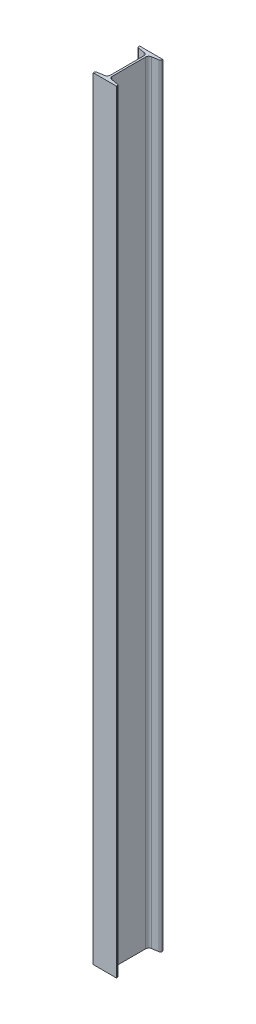
ISO-10303-21;
HEADER;
FILE_DESCRIPTION(('STEP AP214'),'2;1');
FILE_NAME('part.step','',(''),(''),'','','');
FILE_SCHEMA(('AUTOMOTIVE_DESIGN { 1 0 10303 214 1 1 1 1 }'));
ENDSEC;
DATA;
#1=APPLICATION_CONTEXT('core data for automotive mechanical design processes');
#2=APPLICATION_PROTOCOL_DEFINITION('international standard','automotive_design',2000,#1);
#3=PRODUCT_CONTEXT('',#1,'mechanical');
#4=PRODUCT('Part','Part','',(#3));
#5=PRODUCT_RELATED_PRODUCT_CATEGORY('part','',(#4));
#6=PRODUCT_DEFINITION_FORMATION('','',#4);
#7=PRODUCT_DEFINITION_CONTEXT('part definition',#1,'design');
#8=PRODUCT_DEFINITION('design','',#6,#7);
#9=PRODUCT_DEFINITION_SHAPE('','',#8);
#10=(LENGTH_UNIT() NAMED_UNIT(*) SI_UNIT(.MILLI.,.METRE.));
#11=(NAMED_UNIT(*) PLANE_ANGLE_UNIT() SI_UNIT($,.RADIAN.));
#12=(NAMED_UNIT(*) SI_UNIT($,.STERADIAN.) SOLID_ANGLE_UNIT());
#13=UNCERTAINTY_MEASURE_WITH_UNIT(LENGTH_MEASURE(1.E-05),#10,'distance_accuracy_value','');
#14=(GEOMETRIC_REPRESENTATION_CONTEXT(3) GLOBAL_UNCERTAINTY_ASSIGNED_CONTEXT((#13)) GLOBAL_UNIT_ASSIGNED_CONTEXT((#10,
#11,#12)) REPRESENTATION_CONTEXT('',''));
#15=CARTESIAN_POINT('',(0.,0.,0.));
#16=DIRECTION('',(0.,0.,1.));
#17=DIRECTION('',(1.,0.,0.));
#18=AXIS2_PLACEMENT_3D('',#15,#16,#17);
#19=CARTESIAN_POINT('',(-30.,2000.,-60.));
#20=DIRECTION('',(0.,0.,1.));
#21=DIRECTION('',(1.,0.,0.));
#22=AXIS2_PLACEMENT_3D('',#19,#20,#21);
#23=PLANE('',#22);
#24=DIRECTION('',(-1.,0.,0.));
#25=VECTOR('',#24,1.);
#26=CARTESIAN_POINT('',(-30.,0.,-60.));
#27=LINE('',#26,#25);
#28=CARTESIAN_POINT('',(30.,0.,-60.));
#29=VERTEX_POINT('',#28);
#30=CARTESIAN_POINT('',(-30.,0.,-60.));
#31=VERTEX_POINT('',#30);
#32=EDGE_CURVE('E271',#29,#31,#27,.T.);
#33=ORIENTED_EDGE('',*,*,#32,.T.);
#34=DIRECTION('',(0.,-1.,0.));
#35=VECTOR('',#34,1.);
#36=CARTESIAN_POINT('',(-30.,2000.,-60.));
#37=LINE('',#36,#35);
#38=CARTESIAN_POINT('',(-30.,2000.,-60.));
#39=VERTEX_POINT('',#38);
#40=EDGE_CURVE('E13',#39,#31,#37,.T.);
#41=ORIENTED_EDGE('',*,*,#40,.F.);
#42=DIRECTION('',(-1.,0.,0.));
#43=VECTOR('',#42,1.);
#44=CARTESIAN_POINT('',(-30.,2000.,-60.));
#45=LINE('',#44,#43);
#46=CARTESIAN_POINT('',(30.,2000.,-60.));
#47=VERTEX_POINT('',#46);
#48=EDGE_CURVE('E309',#47,#39,#45,.T.);
#49=ORIENTED_EDGE('',*,*,#48,.F.);
#50=DIRECTION('',(0.,-1.,0.));
#51=VECTOR('',#50,1.);
#52=CARTESIAN_POINT('',(30.,2000.,-60.));
#53=LINE('',#52,#51);
#54=EDGE_CURVE('E267',#47,#29,#53,.T.);
#55=ORIENTED_EDGE('',*,*,#54,.T.);
#56=EDGE_LOOP('',(#33,#41,#49,#55));
#57=FACE_BOUND('',#56,.T.);
#58=ADVANCED_FACE('F103',(#57),#23,.F.);
#59=CARTESIAN_POINT('',(-30.,2000.,-58.0800708346734));
#60=DIRECTION('',(1.,0.,0.));
#61=DIRECTION('',(0.,0.,-1.));
#62=AXIS2_PLACEMENT_3D('',#59,#60,#61);
#63=PLANE('',#62);
#64=DIRECTION('',(0.,0.,1.));
#65=VECTOR('',#64,1.);
#66=CARTESIAN_POINT('',(-30.,0.,-58.0800708346734));
#67=LINE('',#66,#65);
#68=CARTESIAN_POINT('',(-30.,0.,-58.0800708346734));
#69=VERTEX_POINT('',#68);
#70=EDGE_CURVE('E274',#31,#69,#67,.T.);
#71=ORIENTED_EDGE('',*,*,#70,.T.);
#72=DIRECTION('',(0.,-1.,0.));
#73=VECTOR('',#72,1.);
#74=CARTESIAN_POINT('',(-30.,2000.,-58.0800708346734));
#75=LINE('',#74,#73);
#76=CARTESIAN_POINT('',(-30.,2000.,-58.0800708346734));
#77=VERTEX_POINT('',#76);
#78=EDGE_CURVE('E111',#77,#69,#75,.T.);
#79=ORIENTED_EDGE('',*,*,#78,.F.);
#80=DIRECTION('',(0.,0.,1.));
#81=VECTOR('',#80,1.);
#82=CARTESIAN_POINT('',(-30.,2000.,-58.0800708346734));
#83=LINE('',#82,#81);
#84=EDGE_CURVE('E198',#39,#77,#83,.T.);
#85=ORIENTED_EDGE('',*,*,#84,.F.);
#86=ORIENTED_EDGE('',*,*,#40,.T.);
#87=EDGE_LOOP('',(#71,#79,#85,#86));
#88=FACE_BOUND('',#87,.T.);
#89=ADVANCED_FACE('F427',(#88),#63,.F.);
#90=CARTESIAN_POINT('',(-26.,2000.,-58.0800708346734));
#91=DIRECTION('',(0.,-1.,0.));
#92=DIRECTION('',(0.,0.,-1.));
#93=AXIS2_PLACEMENT_3D('',#90,#91,#92);
#94=CYLINDRICAL_SURFACE('',#93,4.00000000000001);
#95=CARTESIAN_POINT('',(-26.,0.,-58.0800708346734));
#96=DIRECTION('',(0.,1.,0.));
#97=DIRECTION('',(0.,0.,1.));
#98=AXIS2_PLACEMENT_3D('',#95,#96,#97);
#99=CIRCLE('',#98,4.00000000000001);
#100=CARTESIAN_POINT('',(-26.6576426241585,0.,-54.1345029187848));
#101=VERTEX_POINT('',#100);
#102=EDGE_CURVE('E276',#69,#101,#99,.T.);
#103=ORIENTED_EDGE('',*,*,#102,.T.);
#104=DIRECTION('',(0.,-1.,0.));
#105=VECTOR('',#104,1.);
#106=CARTESIAN_POINT('',(-26.6576426241585,2000.,-54.1345029187848));
#107=LINE('',#106,#105);
#108=CARTESIAN_POINT('',(-26.6576426241585,2000.,-54.1345029187848));
#109=VERTEX_POINT('',#108);
#110=EDGE_CURVE('E352',#109,#101,#107,.T.);
#111=ORIENTED_EDGE('',*,*,#110,.F.);
#112=CARTESIAN_POINT('',(-26.,2000.,-58.0800708346734));
#113=DIRECTION('',(0.,1.,0.));
#114=DIRECTION('',(0.,0.,1.));
#115=AXIS2_PLACEMENT_3D('',#112,#113,#114);
#116=CIRCLE('',#115,4.00000000000001);
#117=EDGE_CURVE('E360',#77,#109,#116,.T.);
#118=ORIENTED_EDGE('',*,*,#117,.F.);
#119=ORIENTED_EDGE('',*,*,#78,.T.);
#120=EDGE_LOOP('',(#103,#111,#118,#119));
#121=FACE_BOUND('',#120,.T.);
#122=ADVANCED_FACE('F358',(#121),#94,.T.);
#123=CARTESIAN_POINT('',(-9.18471475168301,2000.,-51.2221358317773));
#124=DIRECTION('',(0.164410656039623,0.,-0.986391978972163));
#125=DIRECTION('',(-0.986391978972163,0.,-0.164410656039623));
#126=AXIS2_PLACEMENT_3D('',#123,#124,#125);
#127=PLANE('',#126);
#128=DIRECTION('',(0.986391978972163,0.,0.164410656039623));
#129=VECTOR('',#128,1.);
#130=CARTESIAN_POINT('',(-9.18471475168301,0.,-51.2221358317773));
#131=LINE('',#130,#129);
#132=CARTESIAN_POINT('',(-9.18471475168301,0.,-51.2221358317773));
#133=VERTEX_POINT('',#132);
#134=EDGE_CURVE('E278',#101,#133,#131,.T.);
#135=ORIENTED_EDGE('',*,*,#134,.T.);
#136=DIRECTION('',(0.,-1.,0.));
#137=VECTOR('',#136,1.);
#138=CARTESIAN_POINT('',(-9.18471475168301,2000.,-51.2221358317773));
#139=LINE('',#138,#137);
#140=CARTESIAN_POINT('',(-9.18471475168301,2000.,-51.2221358317773));
#141=VERTEX_POINT('',#140);
#142=EDGE_CURVE('E349',#141,#133,#139,.T.);
#143=ORIENTED_EDGE('',*,*,#142,.F.);
#144=DIRECTION('',(0.986391978972163,0.,0.164410656039623));
#145=VECTOR('',#144,1.);
#146=CARTESIAN_POINT('',(-9.18471475168301,2000.,-51.2221358317773));
#147=LINE('',#146,#145);
#148=EDGE_CURVE('E378',#109,#141,#147,.T.);
#149=ORIENTED_EDGE('',*,*,#148,.F.);
#150=ORIENTED_EDGE('',*,*,#110,.T.);
#151=EDGE_LOOP('',(#135,#143,#149,#150));
#152=FACE_BOUND('',#151,.T.);
#153=ADVANCED_FACE('F369',(#152),#127,.F.);
#154=CARTESIAN_POINT('',(-10.5,2000.,-43.331));
#155=DIRECTION('',(0.,-1.,0.));
#156=DIRECTION('',(0.,0.,-1.));
#157=AXIS2_PLACEMENT_3D('',#154,#155,#156);
#158=CYLINDRICAL_SURFACE('',#157,8.);
#159=CARTESIAN_POINT('',(-10.5,0.,-43.331));
#160=DIRECTION('',(0.,-1.,0.));
#161=DIRECTION('',(0.,0.,1.));
#162=AXIS2_PLACEMENT_3D('',#159,#160,#161);
#163=CIRCLE('',#162,8.);
#164=CARTESIAN_POINT('',(-2.5,0.,-43.331));
#165=VERTEX_POINT('',#164);
#166=EDGE_CURVE('E280',#133,#165,#163,.T.);
#167=ORIENTED_EDGE('',*,*,#166,.T.);
#168=DIRECTION('',(0.,-1.,0.));
#169=VECTOR('',#168,1.);
#170=CARTESIAN_POINT('',(-2.5,2000.,-43.331));
#171=LINE('',#170,#169);
#172=CARTESIAN_POINT('',(-2.5,2000.,-43.331));
#173=VERTEX_POINT('',#172);
#174=EDGE_CURVE('E346',#173,#165,#171,.T.);
#175=ORIENTED_EDGE('',*,*,#174,.F.);
#176=CARTESIAN_POINT('',(-10.5,2000.,-43.331));
#177=DIRECTION('',(0.,-1.,0.));
#178=DIRECTION('',(0.,0.,1.));
#179=AXIS2_PLACEMENT_3D('',#176,#177,#178);
#180=CIRCLE('',#179,8.);
#181=EDGE_CURVE('E375',#141,#173,#180,.T.);
#182=ORIENTED_EDGE('',*,*,#181,.F.);
#183=ORIENTED_EDGE('',*,*,#142,.T.);
#184=EDGE_LOOP('',(#167,#175,#182,#183));
#185=FACE_BOUND('',#184,.T.);
#186=ADVANCED_FACE('F373',(#185),#158,.F.);
#187=CARTESIAN_POINT('',(-2.49999999999999,2000.,43.331));
#188=DIRECTION('',(1.,0.,0.));
#189=DIRECTION('',(0.,0.,-1.));
#190=AXIS2_PLACEMENT_3D('',#187,#188,#189);
#191=PLANE('',#190);
#192=DIRECTION('',(0.,0.,1.));
#193=VECTOR('',#192,1.);
#194=CARTESIAN_POINT('',(-2.49999999999999,0.,43.331));
#195=LINE('',#194,#193);
#196=CARTESIAN_POINT('',(-2.49999999999999,0.,43.331));
#197=VERTEX_POINT('',#196);
#198=EDGE_CURVE('E282',#165,#197,#195,.T.);
#199=ORIENTED_EDGE('',*,*,#198,.T.);
#200=DIRECTION('',(0.,-1.,0.));
#201=VECTOR('',#200,1.);
#202=CARTESIAN_POINT('',(-2.49999999999999,2000.,43.331));
#203=LINE('',#202,#201);
#204=CARTESIAN_POINT('',(-2.49999999999999,2000.,43.331));
#205=VERTEX_POINT('',#204);
#206=EDGE_CURVE('E343',#205,#197,#203,.T.);
#207=ORIENTED_EDGE('',*,*,#206,.F.);
#208=DIRECTION('',(0.,0.,1.));
#209=VECTOR('',#208,1.);
#210=CARTESIAN_POINT('',(-2.49999999999999,2000.,43.331));
#211=LINE('',#210,#209);
#212=EDGE_CURVE('E377',#173,#205,#211,.T.);
#213=ORIENTED_EDGE('',*,*,#212,.F.);
#214=ORIENTED_EDGE('',*,*,#174,.T.);
#215=EDGE_LOOP('',(#199,#207,#213,#214));
#216=FACE_BOUND('',#215,.T.);
#217=ADVANCED_FACE('F440',(#216),#191,.F.);
#218=CARTESIAN_POINT('',(-10.5,2000.,43.331));
#219=DIRECTION('',(0.,-1.,0.));
#220=DIRECTION('',(0.,0.,-1.));
#221=AXIS2_PLACEMENT_3D('',#218,#219,#220);
#222=CYLINDRICAL_SURFACE('',#221,8.);
#223=CARTESIAN_POINT('',(-10.5,0.,43.331));
#224=DIRECTION('',(0.,-1.,0.));
#225=DIRECTION('',(0.,0.,1.));
#226=AXIS2_PLACEMENT_3D('',#223,#224,#225);
#227=CIRCLE('',#226,8.);
#228=CARTESIAN_POINT('',(-9.184714751683,0.,51.2221358317773));
#229=VERTEX_POINT('',#228);
#230=EDGE_CURVE('E284',#197,#229,#227,.T.);
#231=ORIENTED_EDGE('',*,*,#230,.T.);
#232=DIRECTION('',(0.,-1.,0.));
#233=VECTOR('',#232,1.);
#234=CARTESIAN_POINT('',(-9.184714751683,2000.,51.2221358317773));
#235=LINE('',#234,#233);
#236=CARTESIAN_POINT('',(-9.184714751683,2000.,51.2221358317773));
#237=VERTEX_POINT('',#236);
#238=EDGE_CURVE('E340',#237,#229,#235,.T.);
#239=ORIENTED_EDGE('',*,*,#238,.F.);
#240=CARTESIAN_POINT('',(-10.5,2000.,43.331));
#241=DIRECTION('',(0.,-1.,0.));
#242=DIRECTION('',(0.,0.,1.));
#243=AXIS2_PLACEMENT_3D('',#240,#241,#242);
#244=CIRCLE('',#243,8.);
#245=EDGE_CURVE('E380',#205,#237,#244,.T.);
#246=ORIENTED_EDGE('',*,*,#245,.F.);
#247=ORIENTED_EDGE('',*,*,#206,.T.);
#248=EDGE_LOOP('',(#231,#239,#246,#247));
#249=FACE_BOUND('',#248,.T.);
#250=ADVANCED_FACE('F443',(#249),#222,.F.);
#251=CARTESIAN_POINT('',(-26.6576426241585,2000.,54.1345029187848));
#252=DIRECTION('',(0.164410656039624,0.,0.986391978972163));
#253=DIRECTION('',(0.986391978972163,0.,-0.164410656039624));
#254=AXIS2_PLACEMENT_3D('',#251,#252,#253);
#255=PLANE('',#254);
#256=DIRECTION('',(-0.986391978972163,0.,0.164410656039624));
#257=VECTOR('',#256,1.);
#258=CARTESIAN_POINT('',(-26.6576426241585,0.,54.1345029187848));
#259=LINE('',#258,#257);
#260=CARTESIAN_POINT('',(-26.6576426241585,0.,54.1345029187848));
#261=VERTEX_POINT('',#260);
#262=EDGE_CURVE('E286',#229,#261,#259,.T.);
#263=ORIENTED_EDGE('',*,*,#262,.T.);
#264=DIRECTION('',(0.,-1.,0.));
#265=VECTOR('',#264,1.);
#266=CARTESIAN_POINT('',(-26.6576426241585,2000.,54.1345029187848));
#267=LINE('',#266,#265);
#268=CARTESIAN_POINT('',(-26.6576426241585,2000.,54.1345029187848));
#269=VERTEX_POINT('',#268);
#270=EDGE_CURVE('E337',#269,#261,#267,.T.);
#271=ORIENTED_EDGE('',*,*,#270,.F.);
#272=DIRECTION('',(-0.986391978972163,0.,0.164410656039624));
#273=VECTOR('',#272,1.);
#274=CARTESIAN_POINT('',(-26.6576426241585,2000.,54.1345029187848));
#275=LINE('',#274,#273);
#276=EDGE_CURVE('E386',#237,#269,#275,.T.);
#277=ORIENTED_EDGE('',*,*,#276,.F.);
#278=ORIENTED_EDGE('',*,*,#238,.T.);
#279=EDGE_LOOP('',(#263,#271,#277,#278));
#280=FACE_BOUND('',#279,.T.);
#281=ADVANCED_FACE('F447',(#280),#255,.F.);
#282=CARTESIAN_POINT('',(-26.,2000.,58.0800708346735));
#283=DIRECTION('',(0.,-1.,0.));
#284=DIRECTION('',(0.,0.,-1.));
#285=AXIS2_PLACEMENT_3D('',#282,#283,#284);
#286=CYLINDRICAL_SURFACE('',#285,4.);
#287=CARTESIAN_POINT('',(-26.,0.,58.0800708346735));
#288=DIRECTION('',(0.,1.,0.));
#289=DIRECTION('',(0.,0.,1.));
#290=AXIS2_PLACEMENT_3D('',#287,#288,#289);
#291=CIRCLE('',#290,4.);
#292=CARTESIAN_POINT('',(-30.,0.,58.0800708346735));
#293=VERTEX_POINT('',#292);
#294=EDGE_CURVE('E288',#261,#293,#291,.T.);
#295=ORIENTED_EDGE('',*,*,#294,.T.);
#296=DIRECTION('',(0.,-1.,0.));
#297=VECTOR('',#296,1.);
#298=CARTESIAN_POINT('',(-30.,2000.,58.0800708346735));
#299=LINE('',#298,#297);
#300=CARTESIAN_POINT('',(-30.,2000.,58.0800708346735));
#301=VERTEX_POINT('',#300);
#302=EDGE_CURVE('E334',#301,#293,#299,.T.);
#303=ORIENTED_EDGE('',*,*,#302,.F.);
#304=CARTESIAN_POINT('',(-26.,2000.,58.0800708346735));
#305=DIRECTION('',(0.,1.,0.));
#306=DIRECTION('',(0.,0.,1.));
#307=AXIS2_PLACEMENT_3D('',#304,#305,#306);
#308=CIRCLE('',#307,4.);
#309=EDGE_CURVE('E388',#269,#301,#308,.T.);
#310=ORIENTED_EDGE('',*,*,#309,.F.);
#311=ORIENTED_EDGE('',*,*,#270,.T.);
#312=EDGE_LOOP('',(#295,#303,#310,#311));
#313=FACE_BOUND('',#312,.T.);
#314=ADVANCED_FACE('F451',(#313),#286,.T.);
#315=CARTESIAN_POINT('',(-30.,2000.,60.));
#316=DIRECTION('',(1.,0.,0.));
#317=DIRECTION('',(0.,0.,-1.));
#318=AXIS2_PLACEMENT_3D('',#315,#316,#317);
#319=PLANE('',#318);
#320=DIRECTION('',(0.,0.,1.));
#321=VECTOR('',#320,1.);
#322=CARTESIAN_POINT('',(-30.,0.,60.));
#323=LINE('',#322,#321);
#324=CARTESIAN_POINT('',(-30.,0.,60.));
#325=VERTEX_POINT('',#324);
#326=EDGE_CURVE('E290',#293,#325,#323,.T.);
#327=ORIENTED_EDGE('',*,*,#326,.T.);
#328=DIRECTION('',(0.,-1.,0.));
#329=VECTOR('',#328,1.);
#330=CARTESIAN_POINT('',(-30.,2000.,60.));
#331=LINE('',#330,#329);
#332=CARTESIAN_POINT('',(-30.,2000.,60.));
#333=VERTEX_POINT('',#332);
#334=EDGE_CURVE('E331',#333,#325,#331,.T.);
#335=ORIENTED_EDGE('',*,*,#334,.F.);
#336=DIRECTION('',(0.,0.,1.));
#337=VECTOR('',#336,1.);
#338=CARTESIAN_POINT('',(-30.,2000.,60.));
#339=LINE('',#338,#337);
#340=EDGE_CURVE('E390',#301,#333,#339,.T.);
#341=ORIENTED_EDGE('',*,*,#340,.F.);
#342=ORIENTED_EDGE('',*,*,#302,.T.);
#343=EDGE_LOOP('',(#327,#335,#341,#342));
#344=FACE_BOUND('',#343,.T.);
#345=ADVANCED_FACE('F455',(#344),#319,.F.);
#346=CARTESIAN_POINT('',(30.,2000.,60.));
#347=DIRECTION('',(0.,0.,-1.));
#348=DIRECTION('',(-1.,0.,0.));
#349=AXIS2_PLACEMENT_3D('',#346,#347,#348);
#350=PLANE('',#349);
#351=DIRECTION('',(1.,0.,0.));
#352=VECTOR('',#351,1.);
#353=CARTESIAN_POINT('',(30.,0.,60.));
#354=LINE('',#353,#352);
#355=CARTESIAN_POINT('',(30.,0.,60.));
#356=VERTEX_POINT('',#355);
#357=EDGE_CURVE('E292',#325,#356,#354,.T.);
#358=ORIENTED_EDGE('',*,*,#357,.T.);
#359=DIRECTION('',(0.,-1.,0.));
#360=VECTOR('',#359,1.);
#361=CARTESIAN_POINT('',(30.,2000.,60.));
#362=LINE('',#361,#360);
#363=CARTESIAN_POINT('',(30.,2000.,60.));
#364=VERTEX_POINT('',#363);
#365=EDGE_CURVE('E328',#364,#356,#362,.T.);
#366=ORIENTED_EDGE('',*,*,#365,.F.);
#367=DIRECTION('',(1.,0.,0.));
#368=VECTOR('',#367,1.);
#369=CARTESIAN_POINT('',(30.,2000.,60.));
#370=LINE('',#369,#368);
#371=EDGE_CURVE('E392',#333,#364,#370,.T.);
#372=ORIENTED_EDGE('',*,*,#371,.F.);
#373=ORIENTED_EDGE('',*,*,#334,.T.);
#374=EDGE_LOOP('',(#358,#366,#372,#373));
#375=FACE_BOUND('',#374,.T.);
#376=ADVANCED_FACE('F459',(#375),#350,.F.);
#377=CARTESIAN_POINT('',(30.,2000.,58.0800708346735));
#378=DIRECTION('',(-1.,0.,0.));
#379=DIRECTION('',(0.,0.,1.));
#380=AXIS2_PLACEMENT_3D('',#377,#378,#379);
#381=PLANE('',#380);
#382=DIRECTION('',(0.,0.,-1.));
#383=VECTOR('',#382,1.);
#384=CARTESIAN_POINT('',(30.,0.,58.0800708346735));
#385=LINE('',#384,#383);
#386=CARTESIAN_POINT('',(30.,0.,58.0800708346735));
#387=VERTEX_POINT('',#386);
#388=EDGE_CURVE('E294',#356,#387,#385,.T.);
#389=ORIENTED_EDGE('',*,*,#388,.T.);
#390=DIRECTION('',(0.,-1.,0.));
#391=VECTOR('',#390,1.);
#392=CARTESIAN_POINT('',(30.,2000.,58.0800708346735));
#393=LINE('',#392,#391);
#394=CARTESIAN_POINT('',(30.,2000.,58.0800708346735));
#395=VERTEX_POINT('',#394);
#396=EDGE_CURVE('E325',#395,#387,#393,.T.);
#397=ORIENTED_EDGE('',*,*,#396,.F.);
#398=DIRECTION('',(0.,0.,-1.));
#399=VECTOR('',#398,1.);
#400=CARTESIAN_POINT('',(30.,2000.,58.0800708346735));
#401=LINE('',#400,#399);
#402=EDGE_CURVE('E394',#364,#395,#401,.T.);
#403=ORIENTED_EDGE('',*,*,#402,.F.);
#404=ORIENTED_EDGE('',*,*,#365,.T.);
#405=EDGE_LOOP('',(#389,#397,#403,#404));
#406=FACE_BOUND('',#405,.T.);
#407=ADVANCED_FACE('F463',(#406),#381,.F.);
#408=CARTESIAN_POINT('',(26.,2000.,58.0800708346735));
#409=DIRECTION('',(0.,-1.,0.));
#410=DIRECTION('',(0.,0.,-1.));
#411=AXIS2_PLACEMENT_3D('',#408,#409,#410);
#412=CYLINDRICAL_SURFACE('',#411,4.);
#413=CARTESIAN_POINT('',(26.,0.,58.0800708346735));
#414=DIRECTION('',(0.,1.,0.));
#415=DIRECTION('',(0.,0.,-1.));
#416=AXIS2_PLACEMENT_3D('',#413,#414,#415);
#417=CIRCLE('',#416,4.);
#418=CARTESIAN_POINT('',(26.6576426241585,0.,54.1345029187848));
#419=VERTEX_POINT('',#418);
#420=EDGE_CURVE('E296',#387,#419,#417,.T.);
#421=ORIENTED_EDGE('',*,*,#420,.T.);
#422=DIRECTION('',(0.,-1.,0.));
#423=VECTOR('',#422,1.);
#424=CARTESIAN_POINT('',(26.6576426241585,2000.,54.1345029187848));
#425=LINE('',#424,#423);
#426=CARTESIAN_POINT('',(26.6576426241585,2000.,54.1345029187848));
#427=VERTEX_POINT('',#426);
#428=EDGE_CURVE('E322',#427,#419,#425,.T.);
#429=ORIENTED_EDGE('',*,*,#428,.F.);
#430=CARTESIAN_POINT('',(26.,2000.,58.0800708346735));
#431=DIRECTION('',(0.,1.,0.));
#432=DIRECTION('',(0.,0.,-1.));
#433=AXIS2_PLACEMENT_3D('',#430,#431,#432);
#434=CIRCLE('',#433,4.);
#435=EDGE_CURVE('E396',#395,#427,#434,.T.);
#436=ORIENTED_EDGE('',*,*,#435,.F.);
#437=ORIENTED_EDGE('',*,*,#396,.T.);
#438=EDGE_LOOP('',(#421,#429,#436,#437));
#439=FACE_BOUND('',#438,.T.);
#440=ADVANCED_FACE('F467',(#439),#412,.T.);
#441=CARTESIAN_POINT('',(9.18471475168301,2000.,51.2221358317773));
#442=DIRECTION('',(-0.164410656039624,0.,0.986391978972163));
#443=DIRECTION('',(0.986391978972163,0.,0.164410656039624));
#444=AXIS2_PLACEMENT_3D('',#441,#442,#443);
#445=PLANE('',#444);
#446=DIRECTION('',(-0.986391978972163,0.,-0.164410656039624));
#447=VECTOR('',#446,1.);
#448=CARTESIAN_POINT('',(9.18471475168301,0.,51.2221358317773));
#449=LINE('',#448,#447);
#450=CARTESIAN_POINT('',(9.18471475168301,0.,51.2221358317773));
#451=VERTEX_POINT('',#450);
#452=EDGE_CURVE('E298',#419,#451,#449,.T.);
#453=ORIENTED_EDGE('',*,*,#452,.T.);
#454=DIRECTION('',(0.,-1.,0.));
#455=VECTOR('',#454,1.);
#456=CARTESIAN_POINT('',(9.18471475168301,2000.,51.2221358317773));
#457=LINE('',#456,#455);
#458=CARTESIAN_POINT('',(9.18471475168301,2000.,51.2221358317773));
#459=VERTEX_POINT('',#458);
#460=EDGE_CURVE('E319',#459,#451,#457,.T.);
#461=ORIENTED_EDGE('',*,*,#460,.F.);
#462=DIRECTION('',(-0.986391978972163,0.,-0.164410656039624));
#463=VECTOR('',#462,1.);
#464=CARTESIAN_POINT('',(9.18471475168301,2000.,51.2221358317773));
#465=LINE('',#464,#463);
#466=EDGE_CURVE('E398',#427,#459,#465,.T.);
#467=ORIENTED_EDGE('',*,*,#466,.F.);
#468=ORIENTED_EDGE('',*,*,#428,.T.);
#469=EDGE_LOOP('',(#453,#461,#467,#468));
#470=FACE_BOUND('',#469,.T.);
#471=ADVANCED_FACE('F471',(#470),#445,.F.);
#472=CARTESIAN_POINT('',(10.5,2000.,43.331));
#473=DIRECTION('',(0.,-1.,0.));
#474=DIRECTION('',(0.,0.,-1.));
#475=AXIS2_PLACEMENT_3D('',#472,#473,#474);
#476=CYLINDRICAL_SURFACE('',#475,8.);
#477=CARTESIAN_POINT('',(10.5,0.,43.331));
#478=DIRECTION('',(0.,-1.,0.));
#479=DIRECTION('',(0.,0.,1.));
#480=AXIS2_PLACEMENT_3D('',#477,#478,#479);
#481=CIRCLE('',#480,8.);
#482=CARTESIAN_POINT('',(2.5,0.,43.331));
#483=VERTEX_POINT('',#482);
#484=EDGE_CURVE('E300',#451,#483,#481,.T.);
#485=ORIENTED_EDGE('',*,*,#484,.T.);
#486=DIRECTION('',(0.,-1.,0.));
#487=VECTOR('',#486,1.);
#488=CARTESIAN_POINT('',(2.5,2000.,43.331));
#489=LINE('',#488,#487);
#490=CARTESIAN_POINT('',(2.5,2000.,43.331));
#491=VERTEX_POINT('',#490);
#492=EDGE_CURVE('E316',#491,#483,#489,.T.);
#493=ORIENTED_EDGE('',*,*,#492,.F.);
#494=CARTESIAN_POINT('',(10.5,2000.,43.331));
#495=DIRECTION('',(0.,-1.,0.));
#496=DIRECTION('',(0.,0.,1.));
#497=AXIS2_PLACEMENT_3D('',#494,#495,#496);
#498=CIRCLE('',#497,8.);
#499=EDGE_CURVE('E400',#459,#491,#498,.T.);
#500=ORIENTED_EDGE('',*,*,#499,.F.);
#501=ORIENTED_EDGE('',*,*,#460,.T.);
#502=EDGE_LOOP('',(#485,#493,#500,#501));
#503=FACE_BOUND('',#502,.T.);
#504=ADVANCED_FACE('F475',(#503),#476,.F.);
#505=CARTESIAN_POINT('',(2.5,2000.,-43.331));
#506=DIRECTION('',(-1.,0.,0.));
#507=DIRECTION('',(0.,0.,1.));
#508=AXIS2_PLACEMENT_3D('',#505,#506,#507);
#509=PLANE('',#508);
#510=DIRECTION('',(0.,0.,-1.));
#511=VECTOR('',#510,1.);
#512=CARTESIAN_POINT('',(2.5,0.,-43.331));
#513=LINE('',#512,#511);
#514=CARTESIAN_POINT('',(2.5,0.,-43.331));
#515=VERTEX_POINT('',#514);
#516=EDGE_CURVE('E302',#483,#515,#513,.T.);
#517=ORIENTED_EDGE('',*,*,#516,.T.);
#518=DIRECTION('',(0.,-1.,0.));
#519=VECTOR('',#518,1.);
#520=CARTESIAN_POINT('',(2.5,2000.,-43.331));
#521=LINE('',#520,#519);
#522=CARTESIAN_POINT('',(2.5,2000.,-43.331));
#523=VERTEX_POINT('',#522);
#524=EDGE_CURVE('E313',#523,#515,#521,.T.);
#525=ORIENTED_EDGE('',*,*,#524,.F.);
#526=DIRECTION('',(0.,0.,-1.));
#527=VECTOR('',#526,1.);
#528=CARTESIAN_POINT('',(2.5,2000.,-43.331));
#529=LINE('',#528,#527);
#530=EDGE_CURVE('E402',#491,#523,#529,.T.);
#531=ORIENTED_EDGE('',*,*,#530,.F.);
#532=ORIENTED_EDGE('',*,*,#492,.T.);
#533=EDGE_LOOP('',(#517,#525,#531,#532));
#534=FACE_BOUND('',#533,.T.);
#535=ADVANCED_FACE('F408',(#534),#509,.F.);
#536=CARTESIAN_POINT('',(10.5,2000.,-43.331));
#537=DIRECTION('',(0.,-1.,0.));
#538=DIRECTION('',(0.,0.,-1.));
#539=AXIS2_PLACEMENT_3D('',#536,#537,#538);
#540=CYLINDRICAL_SURFACE('',#539,8.);
#541=CARTESIAN_POINT('',(10.5,0.,-43.331));
#542=DIRECTION('',(0.,-1.,0.));
#543=DIRECTION('',(0.,0.,1.));
#544=AXIS2_PLACEMENT_3D('',#541,#542,#543);
#545=CIRCLE('',#544,8.);
#546=CARTESIAN_POINT('',(9.18471475168302,0.,-51.2221358317773));
#547=VERTEX_POINT('',#546);
#548=EDGE_CURVE('E304',#515,#547,#545,.T.);
#549=ORIENTED_EDGE('',*,*,#548,.T.);
#550=DIRECTION('',(0.,-1.,0.));
#551=VECTOR('',#550,1.);
#552=CARTESIAN_POINT('',(9.18471475168302,2000.,-51.2221358317773));
#553=LINE('',#552,#551);
#554=CARTESIAN_POINT('',(9.18471475168302,2000.,-51.2221358317773));
#555=VERTEX_POINT('',#554);
#556=EDGE_CURVE('E262',#555,#547,#553,.T.);
#557=ORIENTED_EDGE('',*,*,#556,.F.);
#558=CARTESIAN_POINT('',(10.5,2000.,-43.331));
#559=DIRECTION('',(0.,-1.,0.));
#560=DIRECTION('',(0.,0.,1.));
#561=AXIS2_PLACEMENT_3D('',#558,#559,#560);
#562=CIRCLE('',#561,8.);
#563=EDGE_CURVE('E253',#523,#555,#562,.T.);
#564=ORIENTED_EDGE('',*,*,#563,.F.);
#565=ORIENTED_EDGE('',*,*,#524,.T.);
#566=EDGE_LOOP('',(#549,#557,#564,#565));
#567=FACE_BOUND('',#566,.T.);
#568=ADVANCED_FACE('F412',(#567),#540,.F.);
#569=CARTESIAN_POINT('',(26.6576426241585,2000.,-54.1345029187848));
#570=DIRECTION('',(-0.164410656039623,0.,-0.986391978972163));
#571=DIRECTION('',(-0.986391978972163,0.,0.164410656039623));
#572=AXIS2_PLACEMENT_3D('',#569,#570,#571);
#573=PLANE('',#572);
#574=DIRECTION('',(0.986391978972163,0.,-0.164410656039623));
#575=VECTOR('',#574,1.);
#576=CARTESIAN_POINT('',(26.6576426241585,0.,-54.1345029187848));
#577=LINE('',#576,#575);
#578=CARTESIAN_POINT('',(26.6576426241585,0.,-54.1345029187848));
#579=VERTEX_POINT('',#578);
#580=EDGE_CURVE('E261',#547,#579,#577,.T.);
#581=ORIENTED_EDGE('',*,*,#580,.T.);
#582=DIRECTION('',(0.,-1.,0.));
#583=VECTOR('',#582,1.);
#584=CARTESIAN_POINT('',(26.6576426241585,2000.,-54.1345029187848));
#585=LINE('',#584,#583);
#586=CARTESIAN_POINT('',(26.6576426241585,2000.,-54.1345029187848));
#587=VERTEX_POINT('',#586);
#588=EDGE_CURVE('E258',#587,#579,#585,.T.);
#589=ORIENTED_EDGE('',*,*,#588,.F.);
#590=DIRECTION('',(0.986391978972163,0.,-0.164410656039623));
#591=VECTOR('',#590,1.);
#592=CARTESIAN_POINT('',(26.6576426241585,2000.,-54.1345029187848));
#593=LINE('',#592,#591);
#594=EDGE_CURVE('E247',#555,#587,#593,.T.);
#595=ORIENTED_EDGE('',*,*,#594,.F.);
#596=ORIENTED_EDGE('',*,*,#556,.T.);
#597=EDGE_LOOP('',(#581,#589,#595,#596));
#598=FACE_BOUND('',#597,.T.);
#599=ADVANCED_FACE('F259',(#598),#573,.F.);
#600=CARTESIAN_POINT('',(26.,2000.,-58.0800708346734));
#601=DIRECTION('',(0.,-1.,0.));
#602=DIRECTION('',(0.,0.,-1.));
#603=AXIS2_PLACEMENT_3D('',#600,#601,#602);
#604=CYLINDRICAL_SURFACE('',#603,4.);
#605=CARTESIAN_POINT('',(26.,0.,-58.0800708346734));
#606=DIRECTION('',(0.,1.,0.));
#607=DIRECTION('',(0.,0.,-1.));
#608=AXIS2_PLACEMENT_3D('',#605,#606,#607);
#609=CIRCLE('',#608,4.);
#610=CARTESIAN_POINT('',(30.,0.,-58.0800708346734));
#611=VERTEX_POINT('',#610);
#612=EDGE_CURVE('E184',#579,#611,#609,.T.);
#613=ORIENTED_EDGE('',*,*,#612,.T.);
#614=DIRECTION('',(0.,-1.,0.));
#615=VECTOR('',#614,1.);
#616=CARTESIAN_POINT('',(30.,2000.,-58.0800708346734));
#617=LINE('',#616,#615);
#618=CARTESIAN_POINT('',(30.,2000.,-58.0800708346734));
#619=VERTEX_POINT('',#618);
#620=EDGE_CURVE('E263',#619,#611,#617,.T.);
#621=ORIENTED_EDGE('',*,*,#620,.F.);
#622=CARTESIAN_POINT('',(26.,2000.,-58.0800708346734));
#623=DIRECTION('',(0.,1.,0.));
#624=DIRECTION('',(0.,0.,-1.));
#625=AXIS2_PLACEMENT_3D('',#622,#623,#624);
#626=CIRCLE('',#625,4.);
#627=EDGE_CURVE('E251',#587,#619,#626,.T.);
#628=ORIENTED_EDGE('',*,*,#627,.F.);
#629=ORIENTED_EDGE('',*,*,#588,.T.);
#630=EDGE_LOOP('',(#613,#621,#628,#629));
#631=FACE_BOUND('',#630,.T.);
#632=ADVANCED_FACE('F265',(#631),#604,.T.);
#633=CARTESIAN_POINT('',(30.,2000.,-60.));
#634=DIRECTION('',(-1.,0.,0.));
#635=DIRECTION('',(0.,0.,1.));
#636=AXIS2_PLACEMENT_3D('',#633,#634,#635);
#637=PLANE('',#636);
#638=DIRECTION('',(0.,0.,-1.));
#639=VECTOR('',#638,1.);
#640=CARTESIAN_POINT('',(30.,0.,-60.));
#641=LINE('',#640,#639);
#642=EDGE_CURVE('E190',#611,#29,#641,.T.);
#643=ORIENTED_EDGE('',*,*,#642,.T.);
#644=ORIENTED_EDGE('',*,*,#54,.F.);
#645=DIRECTION('',(0.,0.,-1.));
#646=VECTOR('',#645,1.);
#647=CARTESIAN_POINT('',(30.,2000.,-60.));
#648=LINE('',#647,#646);
#649=EDGE_CURVE('E119',#619,#47,#648,.T.);
#650=ORIENTED_EDGE('',*,*,#649,.F.);
#651=ORIENTED_EDGE('',*,*,#620,.T.);
#652=EDGE_LOOP('',(#643,#644,#650,#651));
#653=FACE_BOUND('',#652,.T.);
#654=ADVANCED_FACE('F416',(#653),#637,.F.);
#655=CARTESIAN_POINT('',(26.,2000.,-58.0800708346734));
#656=DIRECTION('',(0.,-1.,0.));
#657=DIRECTION('',(0.,0.,-1.));
#658=AXIS2_PLACEMENT_3D('',#655,#656,#657);
#659=PLANE('',#658);
#660=ORIENTED_EDGE('',*,*,#48,.T.);
#661=ORIENTED_EDGE('',*,*,#84,.T.);
#662=ORIENTED_EDGE('',*,*,#117,.T.);
#663=ORIENTED_EDGE('',*,*,#148,.T.);
#664=ORIENTED_EDGE('',*,*,#181,.T.);
#665=ORIENTED_EDGE('',*,*,#212,.T.);
#666=ORIENTED_EDGE('',*,*,#245,.T.);
#667=ORIENTED_EDGE('',*,*,#276,.T.);
#668=ORIENTED_EDGE('',*,*,#309,.T.);
#669=ORIENTED_EDGE('',*,*,#340,.T.);
#670=ORIENTED_EDGE('',*,*,#371,.T.);
#671=ORIENTED_EDGE('',*,*,#402,.T.);
#672=ORIENTED_EDGE('',*,*,#435,.T.);
#673=ORIENTED_EDGE('',*,*,#466,.T.);
#674=ORIENTED_EDGE('',*,*,#499,.T.);
#675=ORIENTED_EDGE('',*,*,#530,.T.);
#676=ORIENTED_EDGE('',*,*,#563,.T.);
#677=ORIENTED_EDGE('',*,*,#594,.T.);
#678=ORIENTED_EDGE('',*,*,#627,.T.);
#679=ORIENTED_EDGE('',*,*,#649,.T.);
#680=EDGE_LOOP('',(#660,#661,#662,#663,#664,#665,#666,#667,#668,#669,#670,#671,#672,#673,#674,
#675,#676,#677,#678,#679));
#681=FACE_BOUND('',#680,.T.);
#682=ADVANCED_FACE('F249',(#681),#659,.F.);
#683=CARTESIAN_POINT('',(26.,0.,-58.0800708346734));
#684=DIRECTION('',(0.,-1.,0.));
#685=DIRECTION('',(0.,0.,-1.));
#686=AXIS2_PLACEMENT_3D('',#683,#684,#685);
#687=PLANE('',#686);
#688=ORIENTED_EDGE('',*,*,#32,.F.);
#689=ORIENTED_EDGE('',*,*,#642,.F.);
#690=ORIENTED_EDGE('',*,*,#612,.F.);
#691=ORIENTED_EDGE('',*,*,#580,.F.);
#692=ORIENTED_EDGE('',*,*,#548,.F.);
#693=ORIENTED_EDGE('',*,*,#516,.F.);
#694=ORIENTED_EDGE('',*,*,#484,.F.);
#695=ORIENTED_EDGE('',*,*,#452,.F.);
#696=ORIENTED_EDGE('',*,*,#420,.F.);
#697=ORIENTED_EDGE('',*,*,#388,.F.);
#698=ORIENTED_EDGE('',*,*,#357,.F.);
#699=ORIENTED_EDGE('',*,*,#326,.F.);
#700=ORIENTED_EDGE('',*,*,#294,.F.);
#701=ORIENTED_EDGE('',*,*,#262,.F.);
#702=ORIENTED_EDGE('',*,*,#230,.F.);
#703=ORIENTED_EDGE('',*,*,#198,.F.);
#704=ORIENTED_EDGE('',*,*,#166,.F.);
#705=ORIENTED_EDGE('',*,*,#134,.F.);
#706=ORIENTED_EDGE('',*,*,#102,.F.);
#707=ORIENTED_EDGE('',*,*,#70,.F.);
#708=EDGE_LOOP('',(#688,#689,#690,#691,#692,#693,#694,#695,#696,#697,#698,#699,#700,#701,#702,
#703,#704,#705,#706,#707));
#709=FACE_BOUND('',#708,.T.);
#710=ADVANCED_FACE('F364',(#709),#687,.T.);
#711=CLOSED_SHELL('',(#58,#89,#122,#153,#186,#217,#250,#281,#314,#345,#376,#407,#440,#471,#504,
#535,#568,#599,#632,#654,#682,#710));
#712=MANIFOLD_SOLID_BREP('B2',#711);
#713=ADVANCED_BREP_SHAPE_REPRESENTATION('',(#18,#712),#14);
#714=SHAPE_DEFINITION_REPRESENTATION(#9,#713);
ENDSEC;
END-ISO-10303-21;
